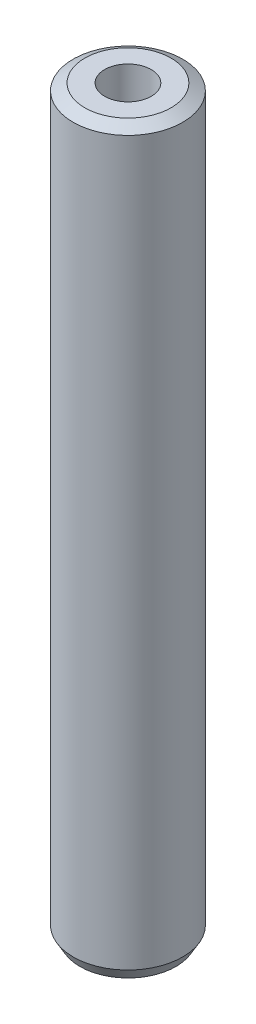
ISO-10303-21;
HEADER;
FILE_DESCRIPTION(('STEP AP214'),'2;1');
FILE_NAME('part.step','',(''),(''),'','','');
FILE_SCHEMA(('AUTOMOTIVE_DESIGN { 1 0 10303 214 1 1 1 1 }'));
ENDSEC;
DATA;
#1=APPLICATION_CONTEXT('core data for automotive mechanical design processes');
#2=APPLICATION_PROTOCOL_DEFINITION('international standard','automotive_design',2000,#1);
#3=PRODUCT_CONTEXT('',#1,'mechanical');
#4=PRODUCT('Part','Part','',(#3));
#5=PRODUCT_RELATED_PRODUCT_CATEGORY('part','',(#4));
#6=PRODUCT_DEFINITION_FORMATION('','',#4);
#7=PRODUCT_DEFINITION_CONTEXT('part definition',#1,'design');
#8=PRODUCT_DEFINITION('design','',#6,#7);
#9=PRODUCT_DEFINITION_SHAPE('','',#8);
#10=(LENGTH_UNIT() NAMED_UNIT(*) SI_UNIT(.MILLI.,.METRE.));
#11=(NAMED_UNIT(*) PLANE_ANGLE_UNIT() SI_UNIT($,.RADIAN.));
#12=(NAMED_UNIT(*) SI_UNIT($,.STERADIAN.) SOLID_ANGLE_UNIT());
#13=UNCERTAINTY_MEASURE_WITH_UNIT(LENGTH_MEASURE(1.E-05),#10,'distance_accuracy_value','');
#14=(GEOMETRIC_REPRESENTATION_CONTEXT(3) GLOBAL_UNCERTAINTY_ASSIGNED_CONTEXT((#13)) GLOBAL_UNIT_ASSIGNED_CONTEXT((#10,
#11,#12)) REPRESENTATION_CONTEXT('',''));
#15=CARTESIAN_POINT('',(0.,0.,0.));
#16=DIRECTION('',(0.,0.,1.));
#17=DIRECTION('',(1.,0.,0.));
#18=AXIS2_PLACEMENT_3D('',#15,#16,#17);
#19=CARTESIAN_POINT('',(0.,135.342148537781,0.));
#20=DIRECTION('',(0.,-1.,0.));
#21=DIRECTION('',(0.,0.,-1.));
#22=AXIS2_PLACEMENT_3D('',#19,#20,#21);
#23=CYLINDRICAL_SURFACE('',#22,10.);
#24=CARTESIAN_POINT('',(0.,134.112438784654,0.));
#25=DIRECTION('',(0.,1.,0.));
#26=DIRECTION('',(0.,0.,1.));
#27=AXIS2_PLACEMENT_3D('',#24,#25,#26);
#28=CIRCLE('',#27,10.);
#29=CARTESIAN_POINT('',(0.,134.112438784654,10.));
#30=VERTEX_POINT('',#29);
#31=EDGE_CURVE('E50',#30,#30,#28,.F.);
#32=ORIENTED_EDGE('',*,*,#31,.T.);
#33=EDGE_LOOP('',(#32));
#34=FACE_BOUND('',#33,.T.);
#35=CARTESIAN_POINT('',(0.,2.12991977097771,0.));
#36=DIRECTION('',(0.,1.,0.));
#37=DIRECTION('',(0.,0.,1.));
#38=AXIS2_PLACEMENT_3D('',#35,#36,#37);
#39=CIRCLE('',#38,10.);
#40=CARTESIAN_POINT('',(0.,2.12991977097771,10.));
#41=VERTEX_POINT('',#40);
#42=EDGE_CURVE('E51',#41,#41,#39,.T.);
#43=ORIENTED_EDGE('',*,*,#42,.T.);
#44=EDGE_LOOP('',(#43));
#45=FACE_BOUND('',#44,.T.);
#46=ADVANCED_FACE('F39',(#34,#45),#23,.T.);
#47=CARTESIAN_POINT('',(0.,135.342148537781,0.));
#48=DIRECTION('',(0.,1.,0.));
#49=DIRECTION('',(0.,0.,1.));
#50=AXIS2_PLACEMENT_3D('',#47,#48,#49);
#51=PLANE('',#50);
#52=CARTESIAN_POINT('',(0.,135.342148537781,0.));
#53=DIRECTION('',(0.,1.,0.));
#54=DIRECTION('',(0.,0.,1.));
#55=AXIS2_PLACEMENT_3D('',#52,#53,#54);
#56=CIRCLE('',#55,7.87008022902234);
#57=CARTESIAN_POINT('',(0.,135.342148537781,7.87008022902234));
#58=VERTEX_POINT('',#57);
#59=EDGE_CURVE('E54',#58,#58,#56,.T.);
#60=ORIENTED_EDGE('',*,*,#59,.T.);
#61=EDGE_LOOP('',(#60));
#62=FACE_BOUND('',#61,.T.);
#63=CARTESIAN_POINT('',(0.,135.342148537781,0.));
#64=DIRECTION('',(0.,1.,0.));
#65=DIRECTION('',(0.,0.,1.));
#66=AXIS2_PLACEMENT_3D('',#63,#64,#65);
#67=CIRCLE('',#66,4.2468830960376);
#68=CARTESIAN_POINT('',(0.,135.342148537781,4.2468830960376));
#69=VERTEX_POINT('',#68);
#70=EDGE_CURVE('E58',#69,#69,#67,.T.);
#71=ORIENTED_EDGE('',*,*,#70,.F.);
#72=EDGE_LOOP('',(#71));
#73=FACE_BOUND('',#72,.T.);
#74=ADVANCED_FACE('F69',(#62,#73),#51,.T.);
#75=CARTESIAN_POINT('',(0.,0.,0.));
#76=DIRECTION('',(0.,1.,0.));
#77=DIRECTION('',(0.,0.,1.));
#78=AXIS2_PLACEMENT_3D('',#75,#76,#77);
#79=PLANE('',#78);
#80=CARTESIAN_POINT('',(0.,0.,0.));
#81=DIRECTION('',(0.,1.,0.));
#82=DIRECTION('',(0.,0.,1.));
#83=AXIS2_PLACEMENT_3D('',#80,#81,#82);
#84=CIRCLE('',#83,8.7702902468737);
#85=CARTESIAN_POINT('',(0.,0.,8.7702902468737));
#86=VERTEX_POINT('',#85);
#87=EDGE_CURVE('E10',#86,#86,#84,.F.);
#88=ORIENTED_EDGE('',*,*,#87,.T.);
#89=EDGE_LOOP('',(#88));
#90=FACE_BOUND('',#89,.T.);
#91=CARTESIAN_POINT('',(0.,0.,0.));
#92=DIRECTION('',(0.,1.,0.));
#93=DIRECTION('',(0.,0.,1.));
#94=AXIS2_PLACEMENT_3D('',#91,#92,#93);
#95=CIRCLE('',#94,4.2468830960376);
#96=CARTESIAN_POINT('',(0.,0.,4.2468830960376));
#97=VERTEX_POINT('',#96);
#98=EDGE_CURVE('E63',#97,#97,#95,.T.);
#99=ORIENTED_EDGE('',*,*,#98,.T.);
#100=EDGE_LOOP('',(#99));
#101=FACE_BOUND('',#100,.T.);
#102=ADVANCED_FACE('F75',(#90,#101),#79,.F.);
#103=CARTESIAN_POINT('',(0.,135.342148537781,0.));
#104=DIRECTION('',(0.,-1.,0.));
#105=DIRECTION('',(0.,0.,-1.));
#106=AXIS2_PLACEMENT_3D('',#103,#104,#105);
#107=CYLINDRICAL_SURFACE('',#106,4.2468830960376);
#108=ORIENTED_EDGE('',*,*,#70,.T.);
#109=EDGE_LOOP('',(#108));
#110=FACE_BOUND('',#109,.T.);
#111=ORIENTED_EDGE('',*,*,#98,.F.);
#112=EDGE_LOOP('',(#111));
#113=FACE_BOUND('',#112,.T.);
#114=ADVANCED_FACE('F70',(#110,#113),#107,.F.);
#115=CARTESIAN_POINT('',(0.,135.342148537781,0.));
#116=DIRECTION('',(0.,-1.,0.));
#117=DIRECTION('',(0.,0.,-1.));
#118=AXIS2_PLACEMENT_3D('',#115,#116,#117);
#119=CONICAL_SURFACE('',#118,7.87008022902234,1.04719755119659);
#120=ORIENTED_EDGE('',*,*,#31,.F.);
#121=EDGE_LOOP('',(#120));
#122=FACE_BOUND('',#121,.T.);
#123=ORIENTED_EDGE('',*,*,#59,.F.);
#124=EDGE_LOOP('',(#123));
#125=FACE_BOUND('',#124,.T.);
#126=ADVANCED_FACE('F81',(#122,#125),#119,.T.);
#127=CARTESIAN_POINT('',(0.,2.12991977097771,0.));
#128=DIRECTION('',(0.,1.,0.));
#129=DIRECTION('',(0.,0.,1.));
#130=AXIS2_PLACEMENT_3D('',#127,#128,#129);
#131=CONICAL_SURFACE('',#130,10.,0.523598775598304);
#132=ORIENTED_EDGE('',*,*,#87,.F.);
#133=EDGE_LOOP('',(#132));
#134=FACE_BOUND('',#133,.T.);
#135=ORIENTED_EDGE('',*,*,#42,.F.);
#136=EDGE_LOOP('',(#135));
#137=FACE_BOUND('',#136,.T.);
#138=ADVANCED_FACE('F45',(#134,#137),#131,.T.);
#139=CLOSED_SHELL('',(#46,#74,#102,#114,#126,#138));
#140=MANIFOLD_SOLID_BREP('B2',#139);
#141=ADVANCED_BREP_SHAPE_REPRESENTATION('',(#18,#140),#14);
#142=SHAPE_DEFINITION_REPRESENTATION(#9,#141);
ENDSEC;
END-ISO-10303-21;
